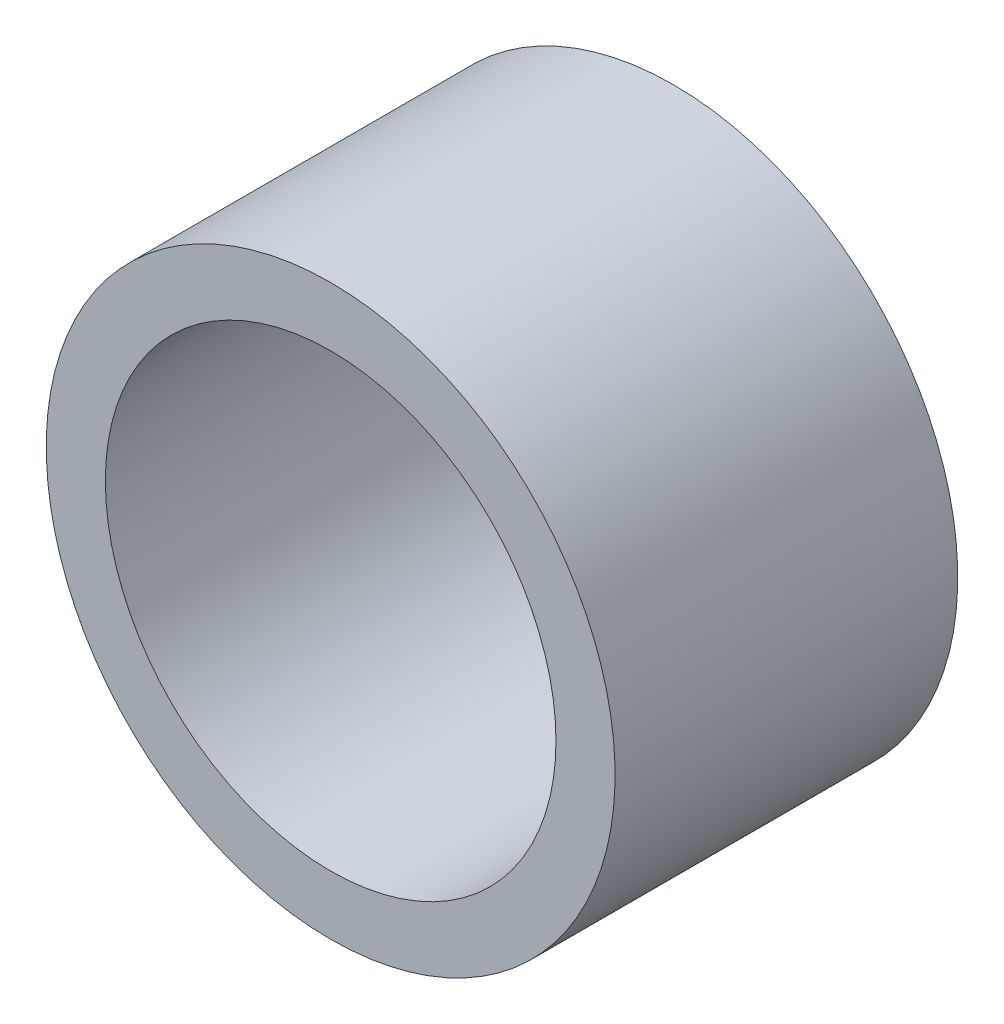
ISO-10303-21;
HEADER;
FILE_DESCRIPTION(('STEP AP214'),'2;1');
FILE_NAME('part.step','',(''),(''),'','','');
FILE_SCHEMA(('AUTOMOTIVE_DESIGN { 1 0 10303 214 1 1 1 1 }'));
ENDSEC;
DATA;
#1=APPLICATION_CONTEXT('core data for automotive mechanical design processes');
#2=APPLICATION_PROTOCOL_DEFINITION('international standard','automotive_design',2000,#1);
#3=PRODUCT_CONTEXT('',#1,'mechanical');
#4=PRODUCT('Part','Part','',(#3));
#5=PRODUCT_RELATED_PRODUCT_CATEGORY('part','',(#4));
#6=PRODUCT_DEFINITION_FORMATION('','',#4);
#7=PRODUCT_DEFINITION_CONTEXT('part definition',#1,'design');
#8=PRODUCT_DEFINITION('design','',#6,#7);
#9=PRODUCT_DEFINITION_SHAPE('','',#8);
#10=(LENGTH_UNIT() NAMED_UNIT(*) SI_UNIT(.MILLI.,.METRE.));
#11=(NAMED_UNIT(*) PLANE_ANGLE_UNIT() SI_UNIT($,.RADIAN.));
#12=(NAMED_UNIT(*) SI_UNIT($,.STERADIAN.) SOLID_ANGLE_UNIT());
#13=UNCERTAINTY_MEASURE_WITH_UNIT(LENGTH_MEASURE(1.E-05),#10,'distance_accuracy_value','');
#14=(GEOMETRIC_REPRESENTATION_CONTEXT(3) GLOBAL_UNCERTAINTY_ASSIGNED_CONTEXT((#13)) GLOBAL_UNIT_ASSIGNED_CONTEXT((#10,
#11,#12)) REPRESENTATION_CONTEXT('',''));
#15=CARTESIAN_POINT('',(0.,0.,0.));
#16=DIRECTION('',(0.,0.,1.));
#17=DIRECTION('',(1.,0.,0.));
#18=AXIS2_PLACEMENT_3D('',#15,#16,#17);
#19=CARTESIAN_POINT('',(11.2281171604993,86.8482589721684,1130.19855376482));
#20=DIRECTION('',(0.,0.,-1.));
#21=DIRECTION('',(0.,1.,0.));
#22=AXIS2_PLACEMENT_3D('',#19,#20,#21);
#23=CYLINDRICAL_SURFACE('',#22,16.7005);
#24=CARTESIAN_POINT('',(11.2281171604993,86.8482589721684,1155.59855376482));
#25=DIRECTION('',(0.,0.,-1.));
#26=DIRECTION('',(0.,1.,0.));
#27=AXIS2_PLACEMENT_3D('',#24,#25,#26);
#28=CIRCLE('',#27,16.7005);
#29=CARTESIAN_POINT('',(11.2281171604993,103.548758972168,1155.59855376482));
#30=VERTEX_POINT('',#29);
#31=EDGE_CURVE('E24',#30,#30,#28,.T.);
#32=ORIENTED_EDGE('',*,*,#31,.F.);
#33=EDGE_LOOP('',(#32));
#34=FACE_BOUND('',#33,.T.);
#35=CARTESIAN_POINT('',(11.2281171604993,86.8482589721684,1130.19855376482));
#36=DIRECTION('',(0.,0.,-1.));
#37=DIRECTION('',(0.,1.,0.));
#38=AXIS2_PLACEMENT_3D('',#35,#36,#37);
#39=CIRCLE('',#38,16.7005);
#40=CARTESIAN_POINT('',(11.2281171604993,103.548758972168,1130.19855376482));
#41=VERTEX_POINT('',#40);
#42=EDGE_CURVE('E15',#41,#41,#39,.T.);
#43=ORIENTED_EDGE('',*,*,#42,.T.);
#44=EDGE_LOOP('',(#43));
#45=FACE_BOUND('',#44,.T.);
#46=ADVANCED_FACE('F12',(#34,#45),#23,.F.);
#47=CARTESIAN_POINT('',(11.2281171604993,86.8482589721684,1130.19855376482));
#48=DIRECTION('',(0.,0.,1.));
#49=DIRECTION('',(0.,-1.,0.));
#50=AXIS2_PLACEMENT_3D('',#47,#48,#49);
#51=PLANE('',#50);
#52=CARTESIAN_POINT('',(11.2281171604993,86.8482589721684,1130.19855376482));
#53=DIRECTION('',(0.,0.,-1.));
#54=DIRECTION('',(0.,1.,0.));
#55=AXIS2_PLACEMENT_3D('',#52,#53,#54);
#56=CIRCLE('',#55,21.082);
#57=CARTESIAN_POINT('',(11.2281171604993,107.930258972168,1130.19855376482));
#58=VERTEX_POINT('',#57);
#59=EDGE_CURVE('E19',#58,#58,#56,.F.);
#60=ORIENTED_EDGE('',*,*,#59,.F.);
#61=EDGE_LOOP('',(#60));
#62=FACE_BOUND('',#61,.T.);
#63=ORIENTED_EDGE('',*,*,#42,.F.);
#64=EDGE_LOOP('',(#63));
#65=FACE_BOUND('',#64,.T.);
#66=ADVANCED_FACE('F33',(#62,#65),#51,.F.);
#67=CARTESIAN_POINT('',(11.2281171604993,86.8482589721684,1155.59855376482));
#68=DIRECTION('',(0.,0.,1.));
#69=DIRECTION('',(0.,-1.,0.));
#70=AXIS2_PLACEMENT_3D('',#67,#68,#69);
#71=PLANE('',#70);
#72=CARTESIAN_POINT('',(11.2281171604993,86.8482589721684,1155.59855376482));
#73=DIRECTION('',(0.,0.,-1.));
#74=DIRECTION('',(0.,1.,0.));
#75=AXIS2_PLACEMENT_3D('',#72,#73,#74);
#76=CIRCLE('',#75,21.082);
#77=CARTESIAN_POINT('',(11.2281171604993,107.930258972168,1155.59855376482));
#78=VERTEX_POINT('',#77);
#79=EDGE_CURVE('E8',#78,#78,#76,.T.);
#80=ORIENTED_EDGE('',*,*,#79,.F.);
#81=EDGE_LOOP('',(#80));
#82=FACE_BOUND('',#81,.T.);
#83=ORIENTED_EDGE('',*,*,#31,.T.);
#84=EDGE_LOOP('',(#83));
#85=FACE_BOUND('',#84,.T.);
#86=ADVANCED_FACE('F35',(#82,#85),#71,.T.);
#87=CARTESIAN_POINT('',(11.2281171604993,86.8482589721684,1130.19855376482));
#88=DIRECTION('',(0.,0.,-1.));
#89=DIRECTION('',(0.,1.,0.));
#90=AXIS2_PLACEMENT_3D('',#87,#88,#89);
#91=CYLINDRICAL_SURFACE('',#90,21.082);
#92=ORIENTED_EDGE('',*,*,#79,.T.);
#93=EDGE_LOOP('',(#92));
#94=FACE_BOUND('',#93,.T.);
#95=ORIENTED_EDGE('',*,*,#59,.T.);
#96=EDGE_LOOP('',(#95));
#97=FACE_BOUND('',#96,.T.);
#98=ADVANCED_FACE('F42',(#94,#97),#91,.T.);
#99=CLOSED_SHELL('',(#46,#66,#86,#98));
#100=MANIFOLD_SOLID_BREP('B1',#99);
#101=ADVANCED_BREP_SHAPE_REPRESENTATION('',(#18,#100),#14);
#102=SHAPE_DEFINITION_REPRESENTATION(#9,#101);
ENDSEC;
END-ISO-10303-21;
